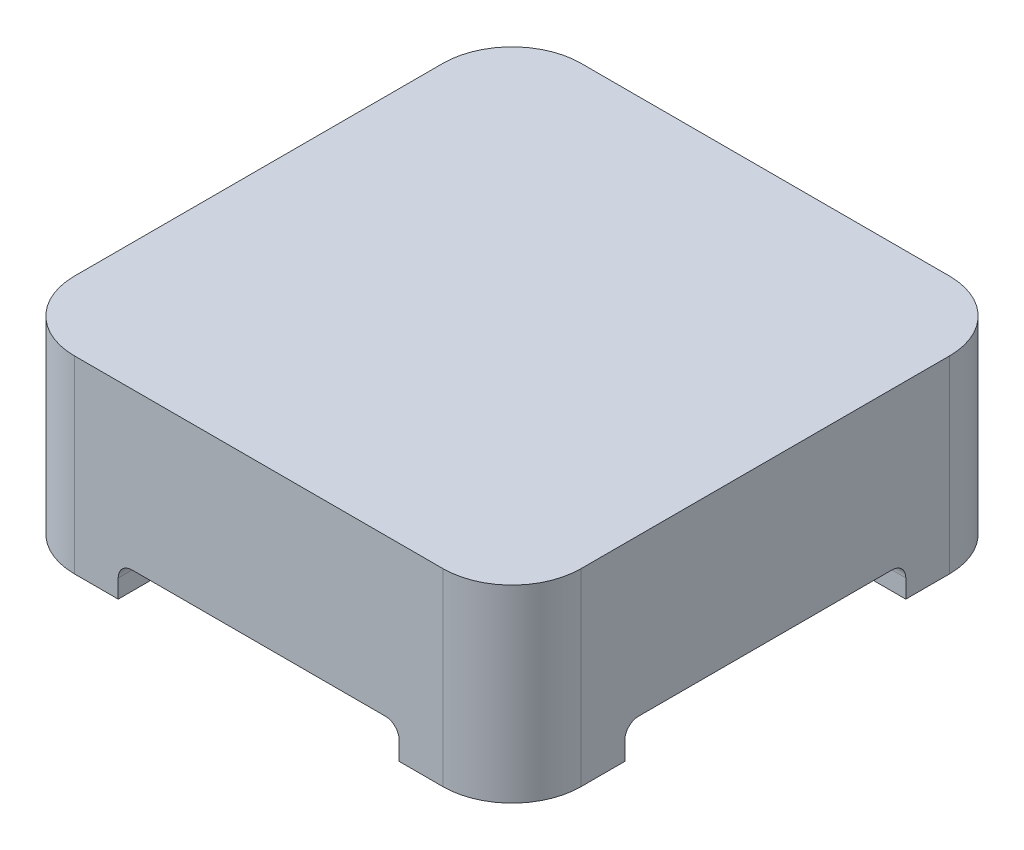
ISO-10303-21;
HEADER;
FILE_DESCRIPTION(('STEP AP214'),'2;1');
FILE_NAME('part.step','',(''),(''),'','','');
FILE_SCHEMA(('AUTOMOTIVE_DESIGN { 1 0 10303 214 1 1 1 1 }'));
ENDSEC;
DATA;
#1=APPLICATION_CONTEXT('core data for automotive mechanical design processes');
#2=APPLICATION_PROTOCOL_DEFINITION('international standard','automotive_design',2000,#1);
#3=PRODUCT_CONTEXT('',#1,'mechanical');
#4=PRODUCT('Part','Part','',(#3));
#5=PRODUCT_RELATED_PRODUCT_CATEGORY('part','',(#4));
#6=PRODUCT_DEFINITION_FORMATION('','',#4);
#7=PRODUCT_DEFINITION_CONTEXT('part definition',#1,'design');
#8=PRODUCT_DEFINITION('design','',#6,#7);
#9=PRODUCT_DEFINITION_SHAPE('','',#8);
#10=(LENGTH_UNIT() NAMED_UNIT(*) SI_UNIT(.MILLI.,.METRE.));
#11=(NAMED_UNIT(*) PLANE_ANGLE_UNIT() SI_UNIT($,.RADIAN.));
#12=(NAMED_UNIT(*) SI_UNIT($,.STERADIAN.) SOLID_ANGLE_UNIT());
#13=UNCERTAINTY_MEASURE_WITH_UNIT(LENGTH_MEASURE(1.E-05),#10,'distance_accuracy_value','');
#14=(GEOMETRIC_REPRESENTATION_CONTEXT(3) GLOBAL_UNCERTAINTY_ASSIGNED_CONTEXT((#13)) GLOBAL_UNIT_ASSIGNED_CONTEXT((#10,
#11,#12)) REPRESENTATION_CONTEXT('',''));
#15=CARTESIAN_POINT('',(0.,0.,0.));
#16=DIRECTION('',(0.,0.,1.));
#17=DIRECTION('',(1.,0.,0.));
#18=AXIS2_PLACEMENT_3D('',#15,#16,#17);
#19=CARTESIAN_POINT('',(0.,-41.,0.));
#20=DIRECTION('',(0.,1.,0.));
#21=DIRECTION('',(0.,0.,1.));
#22=AXIS2_PLACEMENT_3D('',#19,#20,#21);
#23=PLANE('',#22);
#24=DIRECTION('',(0.,0.,1.));
#25=VECTOR('',#24,1.);
#26=CARTESIAN_POINT('',(-55.,-41.,-55.));
#27=LINE('',#26,#25);
#28=CARTESIAN_POINT('',(-55.0000000000001,-41.,30.5000000000002));
#29=VERTEX_POINT('',#28);
#30=CARTESIAN_POINT('',(-55.,-41.,40.));
#31=VERTEX_POINT('',#30);
#32=EDGE_CURVE('E235',#29,#31,#27,.T.);
#33=ORIENTED_EDGE('',*,*,#32,.F.);
#34=DIRECTION('',(1.,0.,0.));
#35=VECTOR('',#34,1.);
#36=CARTESIAN_POINT('',(-55.0000000000001,-41.,30.5000000000002));
#37=LINE('',#36,#35);
#38=CARTESIAN_POINT('',(-30.5,-41.,30.5000000000001));
#39=VERTEX_POINT('',#38);
#40=EDGE_CURVE('E373',#29,#39,#37,.T.);
#41=ORIENTED_EDGE('',*,*,#40,.T.);
#42=DIRECTION('',(0.,0.,1.));
#43=VECTOR('',#42,1.);
#44=CARTESIAN_POINT('',(-30.5,-41.,-55.));
#45=LINE('',#44,#43);
#46=CARTESIAN_POINT('',(-30.5,-41.,55.));
#47=VERTEX_POINT('',#46);
#48=EDGE_CURVE('E433',#39,#47,#45,.T.);
#49=ORIENTED_EDGE('',*,*,#48,.T.);
#50=DIRECTION('',(1.,0.,0.));
#51=VECTOR('',#50,1.);
#52=CARTESIAN_POINT('',(-55.,-41.,55.));
#53=LINE('',#52,#51);
#54=CARTESIAN_POINT('',(-40.,-41.,55.));
#55=VERTEX_POINT('',#54);
#56=EDGE_CURVE('E237',#55,#47,#53,.T.);
#57=ORIENTED_EDGE('',*,*,#56,.F.);
#58=CARTESIAN_POINT('',(-40.,-41.,40.));
#59=DIRECTION('',(0.,1.,0.));
#60=DIRECTION('',(0.,0.,1.));
#61=AXIS2_PLACEMENT_3D('',#58,#59,#60);
#62=CIRCLE('',#61,15.);
#63=EDGE_CURVE('E280',#55,#31,#62,.F.);
#64=ORIENTED_EDGE('',*,*,#63,.T.);
#65=EDGE_LOOP('',(#33,#41,#49,#57,#64));
#66=FACE_BOUND('',#65,.T.);
#67=ADVANCED_FACE('F35',(#66),#23,.F.);
#68=DIRECTION('',(0.,0.,1.));
#69=VECTOR('',#68,1.);
#70=CARTESIAN_POINT('',(30.5,-41.,-55.));
#71=LINE('',#70,#69);
#72=CARTESIAN_POINT('',(30.5,-41.,30.4999999999999));
#73=VERTEX_POINT('',#72);
#74=CARTESIAN_POINT('',(30.5,-41.,55.));
#75=VERTEX_POINT('',#74);
#76=EDGE_CURVE('E319',#73,#75,#71,.T.);
#77=ORIENTED_EDGE('',*,*,#76,.F.);
#78=CARTESIAN_POINT('',(55.0000000000001,-41.,30.4999999999998));
#79=VERTEX_POINT('',#78);
#80=EDGE_CURVE('E371',#73,#79,#37,.T.);
#81=ORIENTED_EDGE('',*,*,#80,.T.);
#82=DIRECTION('',(0.,0.,-1.));
#83=VECTOR('',#82,1.);
#84=CARTESIAN_POINT('',(55.,-41.,-55.));
#85=LINE('',#84,#83);
#86=CARTESIAN_POINT('',(55.,-41.,40.));
#87=VERTEX_POINT('',#86);
#88=EDGE_CURVE('E320',#87,#79,#85,.T.);
#89=ORIENTED_EDGE('',*,*,#88,.F.);
#90=CARTESIAN_POINT('',(40.,-41.,40.));
#91=DIRECTION('',(0.,1.,0.));
#92=DIRECTION('',(0.,0.,1.));
#93=AXIS2_PLACEMENT_3D('',#90,#91,#92);
#94=CIRCLE('',#93,15.);
#95=CARTESIAN_POINT('',(40.,-41.,55.));
#96=VERTEX_POINT('',#95);
#97=EDGE_CURVE('E274',#87,#96,#94,.F.);
#98=ORIENTED_EDGE('',*,*,#97,.T.);
#99=EDGE_CURVE('E234',#75,#96,#53,.T.);
#100=ORIENTED_EDGE('',*,*,#99,.F.);
#101=EDGE_LOOP('',(#77,#81,#89,#98,#100));
#102=FACE_BOUND('',#101,.T.);
#103=ADVANCED_FACE('F370',(#102),#23,.F.);
#104=CARTESIAN_POINT('',(-30.5,-41.,-55.));
#105=DIRECTION('',(-1.,0.,0.));
#106=DIRECTION('',(0.,0.,1.));
#107=AXIS2_PLACEMENT_3D('',#104,#105,#106);
#108=PLANE('',#107);
#109=ORIENTED_EDGE('',*,*,#48,.F.);
#110=DIRECTION('',(0.,1.,0.));
#111=VECTOR('',#110,1.);
#112=CARTESIAN_POINT('',(-30.5,-41.,30.5000000000001));
#113=LINE('',#112,#111);
#114=CARTESIAN_POINT('',(-30.5,-37.,30.5000000000001));
#115=VERTEX_POINT('',#114);
#116=EDGE_CURVE('E403',#39,#115,#113,.T.);
#117=ORIENTED_EDGE('',*,*,#116,.T.);
#118=DIRECTION('',(0.,0.,1.));
#119=VECTOR('',#118,1.);
#120=CARTESIAN_POINT('',(-30.5,-37.,-55.));
#121=LINE('',#120,#119);
#122=CARTESIAN_POINT('',(-30.5,-37.,55.));
#123=VERTEX_POINT('',#122);
#124=EDGE_CURVE('E436',#115,#123,#121,.T.);
#125=ORIENTED_EDGE('',*,*,#124,.T.);
#126=DIRECTION('',(0.,-1.,0.));
#127=VECTOR('',#126,1.);
#128=CARTESIAN_POINT('',(-30.5,-41.,55.));
#129=LINE('',#128,#127);
#130=EDGE_CURVE('E409',#123,#47,#129,.T.);
#131=ORIENTED_EDGE('',*,*,#130,.T.);
#132=EDGE_LOOP('',(#109,#117,#125,#131));
#133=FACE_BOUND('',#132,.T.);
#134=ADVANCED_FACE('F490',(#133),#108,.F.);
#135=CARTESIAN_POINT('',(-27.5,-37.,-55.));
#136=DIRECTION('',(0.,0.,1.));
#137=DIRECTION('',(1.,0.,0.));
#138=AXIS2_PLACEMENT_3D('',#135,#136,#137);
#139=CYLINDRICAL_SURFACE('',#138,3.);
#140=ORIENTED_EDGE('',*,*,#124,.F.);
#141=CARTESIAN_POINT('',(-27.5,-37.,27.5000000000001));
#142=DIRECTION('',(0.707106781186549,0.,0.707106781186546));
#143=DIRECTION('',(-0.707106781186546,0.,0.707106781186549));
#144=AXIS2_PLACEMENT_3D('',#141,#142,#143);
#145=ELLIPSE('',#144,4.24264068711929,3.);
#146=CARTESIAN_POINT('',(-27.5,-34.,27.5000000000001));
#147=VERTEX_POINT('',#146);
#148=EDGE_CURVE('E400',#115,#147,#145,.F.);
#149=ORIENTED_EDGE('',*,*,#148,.T.);
#150=DIRECTION('',(0.,0.,1.));
#151=VECTOR('',#150,1.);
#152=CARTESIAN_POINT('',(-27.5,-34.,-55.));
#153=LINE('',#152,#151);
#154=CARTESIAN_POINT('',(-27.5,-34.,55.));
#155=VERTEX_POINT('',#154);
#156=EDGE_CURVE('E439',#147,#155,#153,.T.);
#157=ORIENTED_EDGE('',*,*,#156,.T.);
#158=CARTESIAN_POINT('',(-27.5,-37.,55.));
#159=DIRECTION('',(0.,0.,1.));
#160=DIRECTION('',(-1.,0.,0.));
#161=AXIS2_PLACEMENT_3D('',#158,#159,#160);
#162=CIRCLE('',#161,3.);
#163=EDGE_CURVE('E427',#155,#123,#162,.T.);
#164=ORIENTED_EDGE('',*,*,#163,.T.);
#165=EDGE_LOOP('',(#140,#149,#157,#164));
#166=FACE_BOUND('',#165,.T.);
#167=ADVANCED_FACE('F496',(#166),#139,.F.);
#168=CARTESIAN_POINT('',(27.5,-37.,-55.));
#169=DIRECTION('',(0.,0.,1.));
#170=DIRECTION('',(1.,0.,0.));
#171=AXIS2_PLACEMENT_3D('',#168,#169,#170);
#172=CYLINDRICAL_SURFACE('',#171,3.);
#173=DIRECTION('',(0.,0.,1.));
#174=VECTOR('',#173,1.);
#175=CARTESIAN_POINT('',(27.5,-34.,-55.));
#176=LINE('',#175,#174);
#177=CARTESIAN_POINT('',(27.5,-34.,27.4999999999999));
#178=VERTEX_POINT('',#177);
#179=CARTESIAN_POINT('',(27.5,-34.,55.));
#180=VERTEX_POINT('',#179);
#181=EDGE_CURVE('E312',#178,#180,#176,.T.);
#182=ORIENTED_EDGE('',*,*,#181,.F.);
#183=CARTESIAN_POINT('',(27.5,-37.,27.4999999999999));
#184=DIRECTION('',(-0.707106781186546,0.,0.707106781186549));
#185=DIRECTION('',(0.707106781186549,0.,0.707106781186546));
#186=AXIS2_PLACEMENT_3D('',#183,#184,#185);
#187=ELLIPSE('',#186,4.24264068711927,3.);
#188=CARTESIAN_POINT('',(30.5,-37.,30.4999999999999));
#189=VERTEX_POINT('',#188);
#190=EDGE_CURVE('E397',#178,#189,#187,.F.);
#191=ORIENTED_EDGE('',*,*,#190,.T.);
#192=DIRECTION('',(0.,0.,1.));
#193=VECTOR('',#192,1.);
#194=CARTESIAN_POINT('',(30.5,-37.,-55.));
#195=LINE('',#194,#193);
#196=CARTESIAN_POINT('',(30.5,-37.,55.));
#197=VERTEX_POINT('',#196);
#198=EDGE_CURVE('E313',#189,#197,#195,.T.);
#199=ORIENTED_EDGE('',*,*,#198,.T.);
#200=CARTESIAN_POINT('',(27.5,-37.,55.));
#201=DIRECTION('',(0.,0.,1.));
#202=DIRECTION('',(-1.,0.,0.));
#203=AXIS2_PLACEMENT_3D('',#200,#201,#202);
#204=CIRCLE('',#203,3.);
#205=EDGE_CURVE('E421',#197,#180,#204,.T.);
#206=ORIENTED_EDGE('',*,*,#205,.T.);
#207=EDGE_LOOP('',(#182,#191,#199,#206));
#208=FACE_BOUND('',#207,.T.);
#209=ADVANCED_FACE('F472',(#208),#172,.F.);
#210=CARTESIAN_POINT('',(30.5,-37.,-55.));
#211=DIRECTION('',(1.,0.,0.));
#212=DIRECTION('',(0.,0.,-1.));
#213=AXIS2_PLACEMENT_3D('',#210,#211,#212);
#214=PLANE('',#213);
#215=ORIENTED_EDGE('',*,*,#198,.F.);
#216=DIRECTION('',(0.,-1.,0.));
#217=VECTOR('',#216,1.);
#218=CARTESIAN_POINT('',(30.5,-37.,30.4999999999999));
#219=LINE('',#218,#217);
#220=EDGE_CURVE('E11',#189,#73,#219,.T.);
#221=ORIENTED_EDGE('',*,*,#220,.T.);
#222=ORIENTED_EDGE('',*,*,#76,.T.);
#223=DIRECTION('',(0.,1.,0.));
#224=VECTOR('',#223,1.);
#225=CARTESIAN_POINT('',(30.5,-37.,55.));
#226=LINE('',#225,#224);
#227=EDGE_CURVE('E406',#75,#197,#226,.T.);
#228=ORIENTED_EDGE('',*,*,#227,.T.);
#229=EDGE_LOOP('',(#215,#221,#222,#228));
#230=FACE_BOUND('',#229,.T.);
#231=ADVANCED_FACE('F515',(#230),#214,.F.);
#232=CARTESIAN_POINT('',(-30.5,-41.,-55.));
#233=VERTEX_POINT('',#232);
#234=CARTESIAN_POINT('',(-30.5,-41.,-30.4999999999999));
#235=VERTEX_POINT('',#234);
#236=EDGE_CURVE('E226',#233,#235,#45,.T.);
#237=ORIENTED_EDGE('',*,*,#236,.T.);
#238=DIRECTION('',(1.,0.,0.));
#239=VECTOR('',#238,1.);
#240=CARTESIAN_POINT('',(-55.0000000000003,-41.,-30.4999999999998));
#241=LINE('',#240,#239);
#242=CARTESIAN_POINT('',(-55.0000000000003,-41.,-30.4999999999998));
#243=VERTEX_POINT('',#242);
#244=EDGE_CURVE('E210',#243,#235,#241,.T.);
#245=ORIENTED_EDGE('',*,*,#244,.F.);
#246=CARTESIAN_POINT('',(-55.,-41.,-40.));
#247=VERTEX_POINT('',#246);
#248=EDGE_CURVE('E223',#247,#243,#27,.T.);
#249=ORIENTED_EDGE('',*,*,#248,.F.);
#250=CARTESIAN_POINT('',(-40.,-41.,-40.));
#251=DIRECTION('',(0.,1.,0.));
#252=DIRECTION('',(0.,0.,1.));
#253=AXIS2_PLACEMENT_3D('',#250,#251,#252);
#254=CIRCLE('',#253,15.);
#255=CARTESIAN_POINT('',(-40.,-41.,-55.));
#256=VERTEX_POINT('',#255);
#257=EDGE_CURVE('E283',#247,#256,#254,.F.);
#258=ORIENTED_EDGE('',*,*,#257,.T.);
#259=DIRECTION('',(-1.,0.,0.));
#260=VECTOR('',#259,1.);
#261=CARTESIAN_POINT('',(-55.,-41.,-55.));
#262=LINE('',#261,#260);
#263=EDGE_CURVE('E322',#233,#256,#262,.T.);
#264=ORIENTED_EDGE('',*,*,#263,.F.);
#265=EDGE_LOOP('',(#237,#245,#249,#258,#264));
#266=FACE_BOUND('',#265,.T.);
#267=ADVANCED_FACE('F221',(#266),#23,.F.);
#268=CARTESIAN_POINT('',(55.,-41.,-55.));
#269=DIRECTION('',(1.,0.,0.));
#270=DIRECTION('',(0.,0.,-1.));
#271=AXIS2_PLACEMENT_3D('',#268,#269,#270);
#272=PLANE('',#271);
#273=DIRECTION('',(0.,-1.,0.));
#274=VECTOR('',#273,1.);
#275=CARTESIAN_POINT('',(55.0000000000001,-41.,30.4999999999998));
#276=LINE('',#275,#274);
#277=CARTESIAN_POINT('',(55.0000000000001,-37.,30.4999999999998));
#278=VERTEX_POINT('',#277);
#279=EDGE_CURVE('E216',#278,#79,#276,.T.);
#280=ORIENTED_EDGE('',*,*,#279,.F.);
#281=CARTESIAN_POINT('',(55.0000000000001,-37.,27.4999999999998));
#282=DIRECTION('',(1.,0.,0.));
#283=DIRECTION('',(0.,0.,1.));
#284=AXIS2_PLACEMENT_3D('',#281,#282,#283);
#285=CIRCLE('',#284,3.);
#286=CARTESIAN_POINT('',(55.0000000000001,-34.,27.4999999999998));
#287=VERTEX_POINT('',#286);
#288=EDGE_CURVE('E462',#287,#278,#285,.T.);
#289=ORIENTED_EDGE('',*,*,#288,.F.);
#290=DIRECTION('',(0.,0.,1.));
#291=VECTOR('',#290,1.);
#292=CARTESIAN_POINT('',(55.0000000000001,-34.,27.4999999999998));
#293=LINE('',#292,#291);
#294=CARTESIAN_POINT('',(54.9999999999999,-34.,-27.5000000000002));
#295=VERTEX_POINT('',#294);
#296=EDGE_CURVE('E461',#295,#287,#293,.T.);
#297=ORIENTED_EDGE('',*,*,#296,.F.);
#298=CARTESIAN_POINT('',(54.9999999999999,-37.,-27.5000000000002));
#299=DIRECTION('',(1.,0.,0.));
#300=DIRECTION('',(0.,0.,1.));
#301=AXIS2_PLACEMENT_3D('',#298,#299,#300);
#302=CIRCLE('',#301,3.);
#303=CARTESIAN_POINT('',(54.9999999999999,-37.,-30.5000000000002));
#304=VERTEX_POINT('',#303);
#305=EDGE_CURVE('E459',#304,#295,#302,.T.);
#306=ORIENTED_EDGE('',*,*,#305,.F.);
#307=DIRECTION('',(0.,1.,0.));
#308=VECTOR('',#307,1.);
#309=CARTESIAN_POINT('',(54.9999999999999,-37.,-30.5000000000002));
#310=LINE('',#309,#308);
#311=CARTESIAN_POINT('',(54.9999999999999,-41.,-30.5000000000002));
#312=VERTEX_POINT('',#311);
#313=EDGE_CURVE('E332',#312,#304,#310,.T.);
#314=ORIENTED_EDGE('',*,*,#313,.F.);
#315=CARTESIAN_POINT('',(55.,-41.,-40.));
#316=VERTEX_POINT('',#315);
#317=EDGE_CURVE('E257',#312,#316,#85,.T.);
#318=ORIENTED_EDGE('',*,*,#317,.T.);
#319=DIRECTION('',(0.,1.,0.));
#320=VECTOR('',#319,1.);
#321=CARTESIAN_POINT('',(55.,-41.,-40.));
#322=LINE('',#321,#320);
#323=CARTESIAN_POINT('',(55.,0.,-40.));
#324=VERTEX_POINT('',#323);
#325=EDGE_CURVE('E292',#316,#324,#322,.T.);
#326=ORIENTED_EDGE('',*,*,#325,.T.);
#327=DIRECTION('',(0.,0.,-1.));
#328=VECTOR('',#327,1.);
#329=CARTESIAN_POINT('',(55.,0.,-55.));
#330=LINE('',#329,#328);
#331=CARTESIAN_POINT('',(55.,0.,40.));
#332=VERTEX_POINT('',#331);
#333=EDGE_CURVE('E245',#332,#324,#330,.T.);
#334=ORIENTED_EDGE('',*,*,#333,.F.);
#335=DIRECTION('',(0.,1.,0.));
#336=VECTOR('',#335,1.);
#337=CARTESIAN_POINT('',(55.,-41.,40.));
#338=LINE('',#337,#336);
#339=EDGE_CURVE('E290',#332,#87,#338,.F.);
#340=ORIENTED_EDGE('',*,*,#339,.T.);
#341=ORIENTED_EDGE('',*,*,#88,.T.);
#342=EDGE_LOOP('',(#280,#289,#297,#306,#314,#318,#326,#334,#340,#341));
#343=FACE_BOUND('',#342,.T.);
#344=ADVANCED_FACE('F328',(#343),#272,.T.);
#345=CARTESIAN_POINT('',(-55.,-41.,55.));
#346=DIRECTION('',(0.,0.,1.));
#347=DIRECTION('',(1.,0.,0.));
#348=AXIS2_PLACEMENT_3D('',#345,#346,#347);
#349=PLANE('',#348);
#350=ORIENTED_EDGE('',*,*,#130,.F.);
#351=ORIENTED_EDGE('',*,*,#163,.F.);
#352=DIRECTION('',(-1.,0.,0.));
#353=VECTOR('',#352,1.);
#354=CARTESIAN_POINT('',(-27.5,-34.,55.));
#355=LINE('',#354,#353);
#356=EDGE_CURVE('E424',#180,#155,#355,.T.);
#357=ORIENTED_EDGE('',*,*,#356,.F.);
#358=ORIENTED_EDGE('',*,*,#205,.F.);
#359=ORIENTED_EDGE('',*,*,#227,.F.);
#360=ORIENTED_EDGE('',*,*,#99,.T.);
#361=DIRECTION('',(0.,1.,0.));
#362=VECTOR('',#361,1.);
#363=CARTESIAN_POINT('',(40.,-41.,55.));
#364=LINE('',#363,#362);
#365=CARTESIAN_POINT('',(40.,0.,55.));
#366=VERTEX_POINT('',#365);
#367=EDGE_CURVE('E285',#96,#366,#364,.T.);
#368=ORIENTED_EDGE('',*,*,#367,.T.);
#369=DIRECTION('',(1.,0.,0.));
#370=VECTOR('',#369,1.);
#371=CARTESIAN_POINT('',(-55.,0.,55.));
#372=LINE('',#371,#370);
#373=CARTESIAN_POINT('',(-40.,0.,55.));
#374=VERTEX_POINT('',#373);
#375=EDGE_CURVE('E254',#374,#366,#372,.T.);
#376=ORIENTED_EDGE('',*,*,#375,.F.);
#377=DIRECTION('',(0.,1.,0.));
#378=VECTOR('',#377,1.);
#379=CARTESIAN_POINT('',(-40.,-41.,55.));
#380=LINE('',#379,#378);
#381=EDGE_CURVE('E288',#374,#55,#380,.F.);
#382=ORIENTED_EDGE('',*,*,#381,.T.);
#383=ORIENTED_EDGE('',*,*,#56,.T.);
#384=EDGE_LOOP('',(#350,#351,#357,#358,#359,#360,#368,#376,#382,#383));
#385=FACE_BOUND('',#384,.T.);
#386=ADVANCED_FACE('F359',(#385),#349,.T.);
#387=CARTESIAN_POINT('',(-55.,-41.,-55.));
#388=DIRECTION('',(-1.,0.,0.));
#389=DIRECTION('',(0.,0.,1.));
#390=AXIS2_PLACEMENT_3D('',#387,#388,#389);
#391=PLANE('',#390);
#392=DIRECTION('',(0.,-1.,0.));
#393=VECTOR('',#392,1.);
#394=CARTESIAN_POINT('',(-55.0000000000001,-41.,30.5000000000002));
#395=LINE('',#394,#393);
#396=CARTESIAN_POINT('',(-55.0000000000001,-37.,30.5000000000002));
#397=VERTEX_POINT('',#396);
#398=EDGE_CURVE('E449',#397,#29,#395,.T.);
#399=ORIENTED_EDGE('',*,*,#398,.T.);
#400=ORIENTED_EDGE('',*,*,#32,.T.);
#401=DIRECTION('',(0.,1.,0.));
#402=VECTOR('',#401,1.);
#403=CARTESIAN_POINT('',(-55.,-41.,40.));
#404=LINE('',#403,#402);
#405=CARTESIAN_POINT('',(-55.,0.,40.));
#406=VERTEX_POINT('',#405);
#407=EDGE_CURVE('E270',#31,#406,#404,.T.);
#408=ORIENTED_EDGE('',*,*,#407,.T.);
#409=DIRECTION('',(0.,0.,1.));
#410=VECTOR('',#409,1.);
#411=CARTESIAN_POINT('',(-55.,0.,-55.));
#412=LINE('',#411,#410);
#413=CARTESIAN_POINT('',(-55.,0.,-40.));
#414=VERTEX_POINT('',#413);
#415=EDGE_CURVE('E251',#414,#406,#412,.T.);
#416=ORIENTED_EDGE('',*,*,#415,.F.);
#417=DIRECTION('',(0.,1.,0.));
#418=VECTOR('',#417,1.);
#419=CARTESIAN_POINT('',(-55.,-41.,-40.));
#420=LINE('',#419,#418);
#421=EDGE_CURVE('E233',#414,#247,#420,.F.);
#422=ORIENTED_EDGE('',*,*,#421,.T.);
#423=ORIENTED_EDGE('',*,*,#248,.T.);
#424=DIRECTION('',(0.,1.,0.));
#425=VECTOR('',#424,1.);
#426=CARTESIAN_POINT('',(-55.0000000000003,-37.,-30.4999999999998));
#427=LINE('',#426,#425);
#428=CARTESIAN_POINT('',(-55.0000000000003,-37.,-30.4999999999998));
#429=VERTEX_POINT('',#428);
#430=EDGE_CURVE('E207',#243,#429,#427,.T.);
#431=ORIENTED_EDGE('',*,*,#430,.T.);
#432=CARTESIAN_POINT('',(-55.0000000000003,-37.,-27.4999999999998));
#433=DIRECTION('',(1.,0.,0.));
#434=DIRECTION('',(0.,0.,1.));
#435=AXIS2_PLACEMENT_3D('',#432,#433,#434);
#436=CIRCLE('',#435,3.);
#437=CARTESIAN_POINT('',(-55.0000000000003,-34.,-27.4999999999998));
#438=VERTEX_POINT('',#437);
#439=EDGE_CURVE('E215',#429,#438,#436,.T.);
#440=ORIENTED_EDGE('',*,*,#439,.T.);
#441=DIRECTION('',(0.,0.,1.));
#442=VECTOR('',#441,1.);
#443=CARTESIAN_POINT('',(-55.0000000000001,-34.,27.5000000000002));
#444=LINE('',#443,#442);
#445=CARTESIAN_POINT('',(-55.0000000000001,-34.,27.5000000000002));
#446=VERTEX_POINT('',#445);
#447=EDGE_CURVE('E454',#438,#446,#444,.T.);
#448=ORIENTED_EDGE('',*,*,#447,.T.);
#449=CARTESIAN_POINT('',(-55.0000000000001,-37.,27.5000000000002));
#450=DIRECTION('',(1.,0.,0.));
#451=DIRECTION('',(0.,0.,1.));
#452=AXIS2_PLACEMENT_3D('',#449,#450,#451);
#453=CIRCLE('',#452,3.);
#454=EDGE_CURVE('E450',#446,#397,#453,.T.);
#455=ORIENTED_EDGE('',*,*,#454,.T.);
#456=EDGE_LOOP('',(#399,#400,#408,#416,#422,#423,#431,#440,#448,#455));
#457=FACE_BOUND('',#456,.T.);
#458=ADVANCED_FACE('F230',(#457),#391,.T.);
#459=CARTESIAN_POINT('',(-55.,-41.,-55.));
#460=DIRECTION('',(0.,0.,-1.));
#461=DIRECTION('',(-1.,0.,0.));
#462=AXIS2_PLACEMENT_3D('',#459,#460,#461);
#463=PLANE('',#462);
#464=DIRECTION('',(0.,-1.,0.));
#465=VECTOR('',#464,1.);
#466=CARTESIAN_POINT('',(-30.5,-41.,-55.));
#467=LINE('',#466,#465);
#468=CARTESIAN_POINT('',(-30.5,-37.,-55.));
#469=VERTEX_POINT('',#468);
#470=EDGE_CURVE('E417',#469,#233,#467,.T.);
#471=ORIENTED_EDGE('',*,*,#470,.T.);
#472=ORIENTED_EDGE('',*,*,#263,.T.);
#473=DIRECTION('',(0.,1.,0.));
#474=VECTOR('',#473,1.);
#475=CARTESIAN_POINT('',(-40.,-41.,-55.));
#476=LINE('',#475,#474);
#477=CARTESIAN_POINT('',(-40.,0.,-55.));
#478=VERTEX_POINT('',#477);
#479=EDGE_CURVE('E259',#256,#478,#476,.T.);
#480=ORIENTED_EDGE('',*,*,#479,.T.);
#481=DIRECTION('',(-1.,0.,0.));
#482=VECTOR('',#481,1.);
#483=CARTESIAN_POINT('',(-55.,0.,-55.));
#484=LINE('',#483,#482);
#485=CARTESIAN_POINT('',(40.,0.,-55.));
#486=VERTEX_POINT('',#485);
#487=EDGE_CURVE('E248',#486,#478,#484,.T.);
#488=ORIENTED_EDGE('',*,*,#487,.F.);
#489=DIRECTION('',(0.,1.,0.));
#490=VECTOR('',#489,1.);
#491=CARTESIAN_POINT('',(40.,-41.,-55.));
#492=LINE('',#491,#490);
#493=CARTESIAN_POINT('',(40.,-41.,-55.));
#494=VERTEX_POINT('',#493);
#495=EDGE_CURVE('E244',#486,#494,#492,.F.);
#496=ORIENTED_EDGE('',*,*,#495,.T.);
#497=CARTESIAN_POINT('',(30.5,-41.,-55.));
#498=VERTEX_POINT('',#497);
#499=EDGE_CURVE('E239',#494,#498,#262,.T.);
#500=ORIENTED_EDGE('',*,*,#499,.T.);
#501=DIRECTION('',(0.,1.,0.));
#502=VECTOR('',#501,1.);
#503=CARTESIAN_POINT('',(30.5,-37.,-55.));
#504=LINE('',#503,#502);
#505=CARTESIAN_POINT('',(30.5,-37.,-55.));
#506=VERTEX_POINT('',#505);
#507=EDGE_CURVE('E407',#498,#506,#504,.T.);
#508=ORIENTED_EDGE('',*,*,#507,.T.);
#509=CARTESIAN_POINT('',(27.5,-37.,-55.));
#510=DIRECTION('',(0.,0.,1.));
#511=DIRECTION('',(-1.,0.,0.));
#512=AXIS2_PLACEMENT_3D('',#509,#510,#511);
#513=CIRCLE('',#512,3.);
#514=CARTESIAN_POINT('',(27.5,-34.,-55.));
#515=VERTEX_POINT('',#514);
#516=EDGE_CURVE('E310',#506,#515,#513,.T.);
#517=ORIENTED_EDGE('',*,*,#516,.T.);
#518=DIRECTION('',(-1.,0.,0.));
#519=VECTOR('',#518,1.);
#520=CARTESIAN_POINT('',(-27.5,-34.,-55.));
#521=LINE('',#520,#519);
#522=CARTESIAN_POINT('',(-27.5,-34.,-55.));
#523=VERTEX_POINT('',#522);
#524=EDGE_CURVE('E411',#515,#523,#521,.T.);
#525=ORIENTED_EDGE('',*,*,#524,.T.);
#526=CARTESIAN_POINT('',(-27.5,-37.,-55.));
#527=DIRECTION('',(0.,0.,1.));
#528=DIRECTION('',(-1.,0.,0.));
#529=AXIS2_PLACEMENT_3D('',#526,#527,#528);
#530=CIRCLE('',#529,3.);
#531=EDGE_CURVE('E414',#523,#469,#530,.T.);
#532=ORIENTED_EDGE('',*,*,#531,.T.);
#533=EDGE_LOOP('',(#471,#472,#480,#488,#496,#500,#508,#517,#525,#532));
#534=FACE_BOUND('',#533,.T.);
#535=ADVANCED_FACE('F346',(#534),#463,.T.);
#536=ORIENTED_EDGE('',*,*,#317,.F.);
#537=CARTESIAN_POINT('',(30.5,-41.,-30.5000000000001));
#538=VERTEX_POINT('',#537);
#539=EDGE_CURVE('E227',#538,#312,#241,.T.);
#540=ORIENTED_EDGE('',*,*,#539,.F.);
#541=EDGE_CURVE('E302',#498,#538,#71,.T.);
#542=ORIENTED_EDGE('',*,*,#541,.F.);
#543=ORIENTED_EDGE('',*,*,#499,.F.);
#544=CARTESIAN_POINT('',(40.,-41.,-40.));
#545=DIRECTION('',(0.,1.,0.));
#546=DIRECTION('',(0.,0.,1.));
#547=AXIS2_PLACEMENT_3D('',#544,#545,#546);
#548=CIRCLE('',#547,15.);
#549=EDGE_CURVE('E277',#494,#316,#548,.F.);
#550=ORIENTED_EDGE('',*,*,#549,.T.);
#551=EDGE_LOOP('',(#536,#540,#542,#543,#550));
#552=FACE_BOUND('',#551,.T.);
#553=ADVANCED_FACE('F336',(#552),#23,.F.);
#554=CARTESIAN_POINT('',(0.,0.,0.));
#555=DIRECTION('',(0.,1.,0.));
#556=DIRECTION('',(0.,0.,1.));
#557=AXIS2_PLACEMENT_3D('',#554,#555,#556);
#558=PLANE('',#557);
#559=ORIENTED_EDGE('',*,*,#487,.T.);
#560=CARTESIAN_POINT('',(-40.,0.,-40.));
#561=DIRECTION('',(0.,1.,0.));
#562=DIRECTION('',(0.,0.,1.));
#563=AXIS2_PLACEMENT_3D('',#560,#561,#562);
#564=CIRCLE('',#563,15.);
#565=EDGE_CURVE('E268',#478,#414,#564,.T.);
#566=ORIENTED_EDGE('',*,*,#565,.T.);
#567=ORIENTED_EDGE('',*,*,#415,.T.);
#568=CARTESIAN_POINT('',(-40.,0.,40.));
#569=DIRECTION('',(0.,1.,0.));
#570=DIRECTION('',(0.,0.,1.));
#571=AXIS2_PLACEMENT_3D('',#568,#569,#570);
#572=CIRCLE('',#571,15.);
#573=EDGE_CURVE('E266',#406,#374,#572,.T.);
#574=ORIENTED_EDGE('',*,*,#573,.T.);
#575=ORIENTED_EDGE('',*,*,#375,.T.);
#576=CARTESIAN_POINT('',(40.,0.,40.));
#577=DIRECTION('',(0.,1.,0.));
#578=DIRECTION('',(0.,0.,1.));
#579=AXIS2_PLACEMENT_3D('',#576,#577,#578);
#580=CIRCLE('',#579,15.);
#581=EDGE_CURVE('E262',#366,#332,#580,.T.);
#582=ORIENTED_EDGE('',*,*,#581,.T.);
#583=ORIENTED_EDGE('',*,*,#333,.T.);
#584=CARTESIAN_POINT('',(40.,0.,-40.));
#585=DIRECTION('',(0.,1.,0.));
#586=DIRECTION('',(0.,0.,1.));
#587=AXIS2_PLACEMENT_3D('',#584,#585,#586);
#588=CIRCLE('',#587,15.);
#589=EDGE_CURVE('E264',#324,#486,#588,.T.);
#590=ORIENTED_EDGE('',*,*,#589,.T.);
#591=EDGE_LOOP('',(#559,#566,#567,#574,#575,#582,#583,#590));
#592=FACE_BOUND('',#591,.T.);
#593=ADVANCED_FACE('F343',(#592),#558,.T.);
#594=CARTESIAN_POINT('',(-40.,-41.,-40.));
#595=DIRECTION('',(0.,1.,0.));
#596=DIRECTION('',(0.,0.,1.));
#597=AXIS2_PLACEMENT_3D('',#594,#595,#596);
#598=CYLINDRICAL_SURFACE('',#597,15.);
#599=ORIENTED_EDGE('',*,*,#257,.F.);
#600=ORIENTED_EDGE('',*,*,#421,.F.);
#601=ORIENTED_EDGE('',*,*,#565,.F.);
#602=ORIENTED_EDGE('',*,*,#479,.F.);
#603=EDGE_LOOP('',(#599,#600,#601,#602));
#604=FACE_BOUND('',#603,.T.);
#605=ADVANCED_FACE('F349',(#604),#598,.T.);
#606=CARTESIAN_POINT('',(-40.,-41.,40.));
#607=DIRECTION('',(0.,1.,0.));
#608=DIRECTION('',(0.,0.,1.));
#609=AXIS2_PLACEMENT_3D('',#606,#607,#608);
#610=CYLINDRICAL_SURFACE('',#609,15.);
#611=ORIENTED_EDGE('',*,*,#63,.F.);
#612=ORIENTED_EDGE('',*,*,#381,.F.);
#613=ORIENTED_EDGE('',*,*,#573,.F.);
#614=ORIENTED_EDGE('',*,*,#407,.F.);
#615=EDGE_LOOP('',(#611,#612,#613,#614));
#616=FACE_BOUND('',#615,.T.);
#617=ADVANCED_FACE('F354',(#616),#610,.T.);
#618=CARTESIAN_POINT('',(40.,-41.,-40.));
#619=DIRECTION('',(0.,1.,0.));
#620=DIRECTION('',(0.,0.,1.));
#621=AXIS2_PLACEMENT_3D('',#618,#619,#620);
#622=CYLINDRICAL_SURFACE('',#621,15.);
#623=ORIENTED_EDGE('',*,*,#549,.F.);
#624=ORIENTED_EDGE('',*,*,#495,.F.);
#625=ORIENTED_EDGE('',*,*,#589,.F.);
#626=ORIENTED_EDGE('',*,*,#325,.F.);
#627=EDGE_LOOP('',(#623,#624,#625,#626));
#628=FACE_BOUND('',#627,.T.);
#629=ADVANCED_FACE('F340',(#628),#622,.T.);
#630=CARTESIAN_POINT('',(40.,-41.,40.));
#631=DIRECTION('',(0.,1.,0.));
#632=DIRECTION('',(0.,0.,1.));
#633=AXIS2_PLACEMENT_3D('',#630,#631,#632);
#634=CYLINDRICAL_SURFACE('',#633,15.);
#635=ORIENTED_EDGE('',*,*,#97,.F.);
#636=ORIENTED_EDGE('',*,*,#339,.F.);
#637=ORIENTED_EDGE('',*,*,#581,.F.);
#638=ORIENTED_EDGE('',*,*,#367,.F.);
#639=EDGE_LOOP('',(#635,#636,#637,#638));
#640=FACE_BOUND('',#639,.T.);
#641=ADVANCED_FACE('F37',(#640),#634,.T.);
#642=CARTESIAN_POINT('',(-30.5,-37.,-30.4999999999999));
#643=VERTEX_POINT('',#642);
#644=EDGE_CURVE('E434',#469,#643,#121,.T.);
#645=ORIENTED_EDGE('',*,*,#644,.T.);
#646=DIRECTION('',(0.,-1.,0.));
#647=VECTOR('',#646,1.);
#648=CARTESIAN_POINT('',(-30.5,-41.,-30.4999999999999));
#649=LINE('',#648,#647);
#650=EDGE_CURVE('E377',#643,#235,#649,.T.);
#651=ORIENTED_EDGE('',*,*,#650,.T.);
#652=ORIENTED_EDGE('',*,*,#236,.F.);
#653=ORIENTED_EDGE('',*,*,#470,.F.);
#654=EDGE_LOOP('',(#645,#651,#652,#653));
#655=FACE_BOUND('',#654,.T.);
#656=ADVANCED_FACE('F487',(#655),#108,.F.);
#657=CARTESIAN_POINT('',(-27.5,-34.,-27.4999999999999));
#658=VERTEX_POINT('',#657);
#659=EDGE_CURVE('E437',#523,#658,#153,.T.);
#660=ORIENTED_EDGE('',*,*,#659,.T.);
#661=CARTESIAN_POINT('',(-27.5,-37.,-27.4999999999999));
#662=DIRECTION('',(-0.707106781186546,0.,0.707106781186549));
#663=DIRECTION('',(0.707106781186549,0.,0.707106781186546));
#664=AXIS2_PLACEMENT_3D('',#661,#662,#663);
#665=ELLIPSE('',#664,4.24264068711927,3.);
#666=EDGE_CURVE('E394',#658,#643,#665,.T.);
#667=ORIENTED_EDGE('',*,*,#666,.T.);
#668=ORIENTED_EDGE('',*,*,#644,.F.);
#669=ORIENTED_EDGE('',*,*,#531,.F.);
#670=EDGE_LOOP('',(#660,#667,#668,#669));
#671=FACE_BOUND('',#670,.T.);
#672=ADVANCED_FACE('F484',(#671),#139,.F.);
#673=CARTESIAN_POINT('',(-27.5,-34.,-55.));
#674=DIRECTION('',(0.,1.,0.));
#675=DIRECTION('',(0.,0.,1.));
#676=AXIS2_PLACEMENT_3D('',#673,#674,#675);
#677=PLANE('',#676);
#678=ORIENTED_EDGE('',*,*,#156,.F.);
#679=DIRECTION('',(1.,0.,0.));
#680=VECTOR('',#679,1.);
#681=CARTESIAN_POINT('',(-55.0000000000001,-34.,27.5000000000002));
#682=LINE('',#681,#680);
#683=EDGE_CURVE('E384',#446,#147,#682,.T.);
#684=ORIENTED_EDGE('',*,*,#683,.F.);
#685=ORIENTED_EDGE('',*,*,#447,.F.);
#686=DIRECTION('',(1.,0.,0.));
#687=VECTOR('',#686,1.);
#688=CARTESIAN_POINT('',(-55.0000000000003,-34.,-27.4999999999998));
#689=LINE('',#688,#687);
#690=EDGE_CURVE('E387',#438,#658,#689,.T.);
#691=ORIENTED_EDGE('',*,*,#690,.T.);
#692=ORIENTED_EDGE('',*,*,#659,.F.);
#693=ORIENTED_EDGE('',*,*,#524,.F.);
#694=CARTESIAN_POINT('',(27.5,-34.,-27.5000000000001));
#695=VERTEX_POINT('',#694);
#696=EDGE_CURVE('E315',#515,#695,#176,.T.);
#697=ORIENTED_EDGE('',*,*,#696,.T.);
#698=EDGE_CURVE('E390',#695,#295,#689,.T.);
#699=ORIENTED_EDGE('',*,*,#698,.T.);
#700=ORIENTED_EDGE('',*,*,#296,.T.);
#701=EDGE_CURVE('E386',#178,#287,#682,.T.);
#702=ORIENTED_EDGE('',*,*,#701,.F.);
#703=ORIENTED_EDGE('',*,*,#181,.T.);
#704=ORIENTED_EDGE('',*,*,#356,.T.);
#705=EDGE_LOOP('',(#678,#684,#685,#691,#692,#693,#697,#699,#700,#702,#703,#704));
#706=FACE_BOUND('',#705,.T.);
#707=ADVANCED_FACE('F446',(#706),#677,.F.);
#708=CARTESIAN_POINT('',(30.5,-37.,-30.5000000000001));
#709=VERTEX_POINT('',#708);
#710=EDGE_CURVE('E299',#506,#709,#195,.T.);
#711=ORIENTED_EDGE('',*,*,#710,.T.);
#712=CARTESIAN_POINT('',(27.5,-37.,-27.5000000000001));
#713=DIRECTION('',(0.707106781186549,0.,0.707106781186546));
#714=DIRECTION('',(-0.707106781186546,0.,0.707106781186549));
#715=AXIS2_PLACEMENT_3D('',#712,#713,#714);
#716=ELLIPSE('',#715,4.24264068711929,3.);
#717=EDGE_CURVE('E307',#709,#695,#716,.T.);
#718=ORIENTED_EDGE('',*,*,#717,.T.);
#719=ORIENTED_EDGE('',*,*,#696,.F.);
#720=ORIENTED_EDGE('',*,*,#516,.F.);
#721=EDGE_LOOP('',(#711,#718,#719,#720));
#722=FACE_BOUND('',#721,.T.);
#723=ADVANCED_FACE('F306',(#722),#172,.F.);
#724=ORIENTED_EDGE('',*,*,#541,.T.);
#725=DIRECTION('',(0.,1.,0.));
#726=VECTOR('',#725,1.);
#727=CARTESIAN_POINT('',(30.5,-37.,-30.5000000000001));
#728=LINE('',#727,#726);
#729=EDGE_CURVE('E43',#538,#709,#728,.T.);
#730=ORIENTED_EDGE('',*,*,#729,.T.);
#731=ORIENTED_EDGE('',*,*,#710,.F.);
#732=ORIENTED_EDGE('',*,*,#507,.F.);
#733=EDGE_LOOP('',(#724,#730,#731,#732));
#734=FACE_BOUND('',#733,.T.);
#735=ADVANCED_FACE('F298',(#734),#214,.F.);
#736=CARTESIAN_POINT('',(-55.0000000000001,-41.,30.5000000000002));
#737=DIRECTION('',(0.,0.,1.));
#738=DIRECTION('',(1.,0.,0.));
#739=AXIS2_PLACEMENT_3D('',#736,#737,#738);
#740=PLANE('',#739);
#741=DIRECTION('',(1.,0.,0.));
#742=VECTOR('',#741,1.);
#743=CARTESIAN_POINT('',(-55.0000000000001,-37.,30.5000000000002));
#744=LINE('',#743,#742);
#745=EDGE_CURVE('E379',#189,#278,#744,.T.);
#746=ORIENTED_EDGE('',*,*,#745,.T.);
#747=ORIENTED_EDGE('',*,*,#279,.T.);
#748=ORIENTED_EDGE('',*,*,#80,.F.);
#749=ORIENTED_EDGE('',*,*,#220,.F.);
#750=EDGE_LOOP('',(#746,#747,#748,#749));
#751=FACE_BOUND('',#750,.T.);
#752=ADVANCED_FACE('F467',(#751),#740,.F.);
#753=CARTESIAN_POINT('',(-55.0000000000003,-37.,-30.4999999999998));
#754=DIRECTION('',(0.,0.,-1.));
#755=DIRECTION('',(-1.,0.,0.));
#756=AXIS2_PLACEMENT_3D('',#753,#754,#755);
#757=PLANE('',#756);
#758=ORIENTED_EDGE('',*,*,#539,.T.);
#759=ORIENTED_EDGE('',*,*,#313,.T.);
#760=DIRECTION('',(1.,0.,0.));
#761=VECTOR('',#760,1.);
#762=CARTESIAN_POINT('',(-55.0000000000003,-37.,-30.4999999999998));
#763=LINE('',#762,#761);
#764=EDGE_CURVE('E58',#709,#304,#763,.T.);
#765=ORIENTED_EDGE('',*,*,#764,.F.);
#766=ORIENTED_EDGE('',*,*,#729,.F.);
#767=EDGE_LOOP('',(#758,#759,#765,#766));
#768=FACE_BOUND('',#767,.T.);
#769=ADVANCED_FACE('F531',(#768),#757,.F.);
#770=CARTESIAN_POINT('',(-55.0000000000003,-37.,-27.4999999999998));
#771=DIRECTION('',(1.,0.,0.));
#772=DIRECTION('',(0.,0.,-1.));
#773=AXIS2_PLACEMENT_3D('',#770,#771,#772);
#774=CYLINDRICAL_SURFACE('',#773,3.);
#775=ORIENTED_EDGE('',*,*,#764,.T.);
#776=ORIENTED_EDGE('',*,*,#305,.T.);
#777=ORIENTED_EDGE('',*,*,#698,.F.);
#778=ORIENTED_EDGE('',*,*,#717,.F.);
#779=EDGE_LOOP('',(#775,#776,#777,#778));
#780=FACE_BOUND('',#779,.T.);
#781=ADVANCED_FACE('F674',(#780),#774,.F.);
#782=CARTESIAN_POINT('',(-55.0000000000001,-37.,27.5000000000002));
#783=DIRECTION('',(1.,0.,0.));
#784=DIRECTION('',(0.,0.,-1.));
#785=AXIS2_PLACEMENT_3D('',#782,#783,#784);
#786=CYLINDRICAL_SURFACE('',#785,3.);
#787=ORIENTED_EDGE('',*,*,#701,.T.);
#788=ORIENTED_EDGE('',*,*,#288,.T.);
#789=ORIENTED_EDGE('',*,*,#745,.F.);
#790=ORIENTED_EDGE('',*,*,#190,.F.);
#791=EDGE_LOOP('',(#787,#788,#789,#790));
#792=FACE_BOUND('',#791,.T.);
#793=ADVANCED_FACE('F681',(#792),#786,.F.);
#794=ORIENTED_EDGE('',*,*,#40,.F.);
#795=ORIENTED_EDGE('',*,*,#398,.F.);
#796=EDGE_CURVE('E374',#397,#115,#744,.T.);
#797=ORIENTED_EDGE('',*,*,#796,.T.);
#798=ORIENTED_EDGE('',*,*,#116,.F.);
#799=EDGE_LOOP('',(#794,#795,#797,#798));
#800=FACE_BOUND('',#799,.T.);
#801=ADVANCED_FACE('F533',(#800),#740,.F.);
#802=ORIENTED_EDGE('',*,*,#796,.F.);
#803=ORIENTED_EDGE('',*,*,#454,.F.);
#804=ORIENTED_EDGE('',*,*,#683,.T.);
#805=ORIENTED_EDGE('',*,*,#148,.F.);
#806=EDGE_LOOP('',(#802,#803,#804,#805));
#807=FACE_BOUND('',#806,.T.);
#808=ADVANCED_FACE('F481',(#807),#786,.F.);
#809=ORIENTED_EDGE('',*,*,#690,.F.);
#810=ORIENTED_EDGE('',*,*,#439,.F.);
#811=EDGE_CURVE('E50',#429,#643,#763,.T.);
#812=ORIENTED_EDGE('',*,*,#811,.T.);
#813=ORIENTED_EDGE('',*,*,#666,.F.);
#814=EDGE_LOOP('',(#809,#810,#812,#813));
#815=FACE_BOUND('',#814,.T.);
#816=ADVANCED_FACE('F483',(#815),#774,.F.);
#817=ORIENTED_EDGE('',*,*,#811,.F.);
#818=ORIENTED_EDGE('',*,*,#430,.F.);
#819=ORIENTED_EDGE('',*,*,#244,.T.);
#820=ORIENTED_EDGE('',*,*,#650,.F.);
#821=EDGE_LOOP('',(#817,#818,#819,#820));
#822=FACE_BOUND('',#821,.T.);
#823=ADVANCED_FACE('F209',(#822),#757,.F.);
#824=CLOSED_SHELL('',(#67,#103,#134,#167,#209,#231,#267,#344,#386,#458,#535,#553,#593,#605,#617,
#629,#641,#656,#672,#707,#723,#735,#752,#769,#781,#793,#801,#808,#816,#823));
#825=MANIFOLD_SOLID_BREP('B2',#824);
#826=ADVANCED_BREP_SHAPE_REPRESENTATION('',(#18,#825),#14);
#827=SHAPE_DEFINITION_REPRESENTATION(#9,#826);
ENDSEC;
END-ISO-10303-21;
